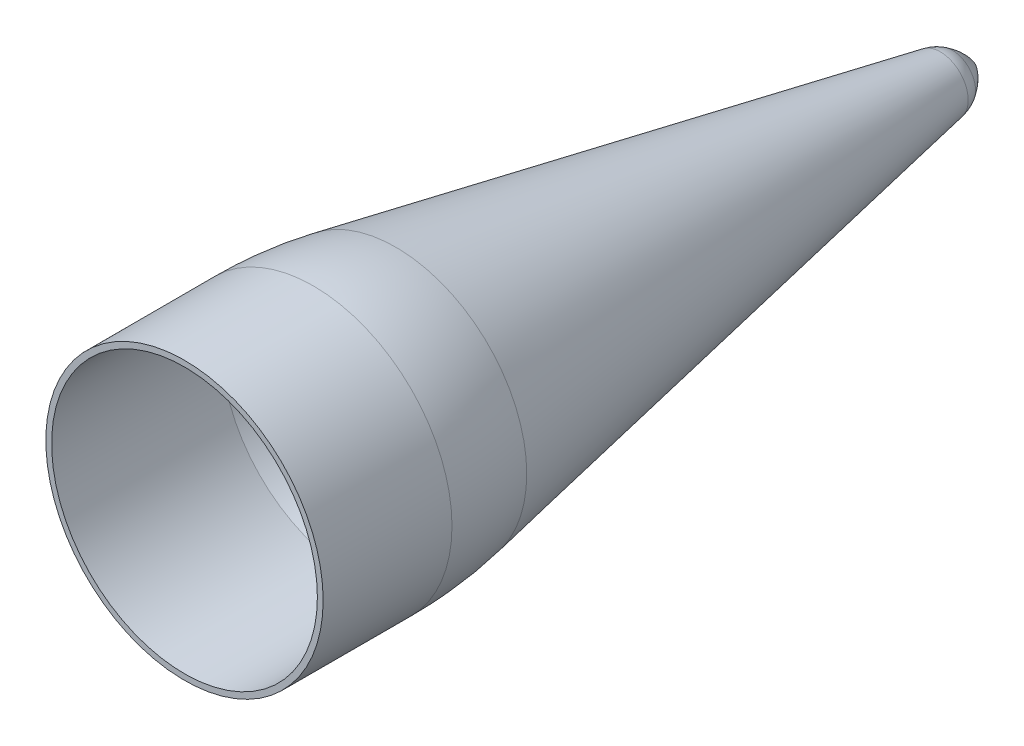
ISO-10303-21;
HEADER;
FILE_DESCRIPTION(('STEP AP214'),'2;1');
FILE_NAME('part.step','',(''),(''),'','','');
FILE_SCHEMA(('AUTOMOTIVE_DESIGN { 1 0 10303 214 1 1 1 1 }'));
ENDSEC;
DATA;
#1=APPLICATION_CONTEXT('core data for automotive mechanical design processes');
#2=APPLICATION_PROTOCOL_DEFINITION('international standard','automotive_design',2000,#1);
#3=PRODUCT_CONTEXT('',#1,'mechanical');
#4=PRODUCT('Part','Part','',(#3));
#5=PRODUCT_RELATED_PRODUCT_CATEGORY('part','',(#4));
#6=PRODUCT_DEFINITION_FORMATION('','',#4);
#7=PRODUCT_DEFINITION_CONTEXT('part definition',#1,'design');
#8=PRODUCT_DEFINITION('design','',#6,#7);
#9=PRODUCT_DEFINITION_SHAPE('','',#8);
#10=(LENGTH_UNIT() NAMED_UNIT(*) SI_UNIT(.MILLI.,.METRE.));
#11=(NAMED_UNIT(*) PLANE_ANGLE_UNIT() SI_UNIT($,.RADIAN.));
#12=(NAMED_UNIT(*) SI_UNIT($,.STERADIAN.) SOLID_ANGLE_UNIT());
#13=UNCERTAINTY_MEASURE_WITH_UNIT(LENGTH_MEASURE(1.E-05),#10,'distance_accuracy_value','');
#14=(GEOMETRIC_REPRESENTATION_CONTEXT(3) GLOBAL_UNCERTAINTY_ASSIGNED_CONTEXT((#13)) GLOBAL_UNIT_ASSIGNED_CONTEXT((#10,
#11,#12)) REPRESENTATION_CONTEXT('',''));
#15=CARTESIAN_POINT('',(0.,0.,0.));
#16=DIRECTION('',(0.,0.,1.));
#17=DIRECTION('',(1.,0.,0.));
#18=AXIS2_PLACEMENT_3D('',#15,#16,#17);
#19=CARTESIAN_POINT('',(0.,0.,0.));
#20=DIRECTION('',(0.,0.,1.));
#21=DIRECTION('',(1.,0.,0.));
#22=AXIS2_PLACEMENT_3D('',#19,#20,#21);
#23=PLANE('',#22);
#24=CARTESIAN_POINT('',(0.,0.,0.));
#25=DIRECTION('',(0.,0.,1.));
#26=DIRECTION('',(1.,0.,0.));
#27=AXIS2_PLACEMENT_3D('',#24,#25,#26);
#28=CIRCLE('',#27,76.073);
#29=CARTESIAN_POINT('',(76.073,0.,0.));
#30=VERTEX_POINT('',#29);
#31=EDGE_CURVE('E68',#30,#30,#28,.T.);
#32=ORIENTED_EDGE('',*,*,#31,.F.);
#33=EDGE_LOOP('',(#32));
#34=FACE_BOUND('',#33,.T.);
#35=CARTESIAN_POINT('',(0.,0.,0.));
#36=DIRECTION('',(0.,0.,1.));
#37=DIRECTION('',(1.,0.,0.));
#38=AXIS2_PLACEMENT_3D('',#35,#36,#37);
#39=CIRCLE('',#38,79.375);
#40=CARTESIAN_POINT('',(79.375,0.,0.));
#41=VERTEX_POINT('',#40);
#42=EDGE_CURVE('E73',#41,#41,#39,.T.);
#43=ORIENTED_EDGE('',*,*,#42,.T.);
#44=EDGE_LOOP('',(#43));
#45=FACE_BOUND('',#44,.T.);
#46=ADVANCED_FACE('F41',(#34,#45),#23,.T.);
#47=CARTESIAN_POINT('',(0.,0.,-20.6182153063899));
#48=DIRECTION('',(0.,0.,1.));
#49=DIRECTION('',(1.,0.,0.));
#50=AXIS2_PLACEMENT_3D('',#47,#48,#49);
#51=CYLINDRICAL_SURFACE('',#50,79.375);
#52=CARTESIAN_POINT('',(0.,0.,-73.747414039917));
#53=DIRECTION('',(0.,0.,-1.));
#54=DIRECTION('',(-1.,0.,0.));
#55=AXIS2_PLACEMENT_3D('',#52,#53,#54);
#56=CIRCLE('',#55,79.375);
#57=CARTESIAN_POINT('',(-79.375,0.,-73.747414039917));
#58=VERTEX_POINT('',#57);
#59=EDGE_CURVE('E76',#58,#58,#56,.F.);
#60=ORIENTED_EDGE('',*,*,#59,.T.);
#61=EDGE_LOOP('',(#60));
#62=FACE_BOUND('',#61,.T.);
#63=ORIENTED_EDGE('',*,*,#42,.F.);
#64=EDGE_LOOP('',(#63));
#65=FACE_BOUND('',#64,.T.);
#66=ADVANCED_FACE('F96',(#62,#65),#51,.T.);
#67=CARTESIAN_POINT('',(0.,0.,-97.5664527808306));
#68=DIRECTION('',(0.,0.,1.));
#69=DIRECTION('',(1.,0.,0.));
#70=AXIS2_PLACEMENT_3D('',#67,#68,#69);
#71=CONICAL_SURFACE('',#70,79.375,0.187004599771542);
#72=CARTESIAN_POINT('',(0.,0.,-432.640757610066));
#73=DIRECTION('',(0.,0.,-1.));
#74=DIRECTION('',(-1.,0.,0.));
#75=AXIS2_PLACEMENT_3D('',#72,#73,#74);
#76=CIRCLE('',#75,15.9737727412674);
#77=CARTESIAN_POINT('',(15.9737727412674,0.,-432.640757610066));
#78=VERTEX_POINT('',#77);
#79=EDGE_CURVE('E49',#78,#78,#76,.F.);
#80=CARTESIAN_POINT('',(0.,0.,-120.97021936672));
#81=DIRECTION('',(0.,0.,-1.));
#82=DIRECTION('',(-1.,0.,0.));
#83=AXIS2_PLACEMENT_3D('',#80,#81,#82);
#84=CIRCLE('',#83,74.9466463404184);
#85=CARTESIAN_POINT('',(74.9466463404184,0.,-120.97021936672));
#86=VERTEX_POINT('',#85);
#87=EDGE_CURVE('E79',#86,#86,#84,.T.);
#88=CARTESIAN_POINT('',(15.9737727412674,0.,-432.640757610066));
#89=CARTESIAN_POINT('',(16.5880735079252,0.,-429.394189503365));
#90=CARTESIAN_POINT('',(17.202374274583,0.,-426.147621396663));
#91=CARTESIAN_POINT('',(18.4309758078987,0.,-419.65448518326));
#92=CARTESIAN_POINT('',(19.0452765745565,0.,-416.407917076559));
#93=CARTESIAN_POINT('',(20.2738781078721,0.,-409.914780863156));
#94=CARTESIAN_POINT('',(20.88817887453,0.,-406.668212756454));
#95=CARTESIAN_POINT('',(22.1167804078456,0.,-400.175076543051));
#96=CARTESIAN_POINT('',(22.7310811745034,0.,-396.92850843635));
#97=CARTESIAN_POINT('',(23.9596827078191,0.,-390.435372222947));
#98=CARTESIAN_POINT('',(24.5739834744769,0.,-387.188804116245));
#99=CARTESIAN_POINT('',(25.8025850077925,0.,-380.695667902842));
#100=CARTESIAN_POINT('',(26.4168857744504,0.,-377.449099796141));
#101=CARTESIAN_POINT('',(27.645487307766,0.,-370.955963582737));
#102=CARTESIAN_POINT('',(28.2597880744238,0.,-367.709395476036));
#103=CARTESIAN_POINT('',(29.4883896077395,0.,-361.216259262633));
#104=CARTESIAN_POINT('',(30.1026903743973,0.,-357.969691155931));
#105=CARTESIAN_POINT('',(31.3312919077129,0.,-351.476554942528));
#106=CARTESIAN_POINT('',(31.9455926743708,0.,-348.229986835827));
#107=CARTESIAN_POINT('',(33.1741942076864,0.,-341.736850622424));
#108=CARTESIAN_POINT('',(33.7884949743442,0.,-338.490282515722));
#109=CARTESIAN_POINT('',(35.0170965076599,0.,-331.997146302319));
#110=CARTESIAN_POINT('',(35.6313972743177,0.,-328.750578195618));
#111=CARTESIAN_POINT('',(36.8599988076334,0.,-322.257441982215));
#112=CARTESIAN_POINT('',(37.4742995742912,0.,-319.010873875513));
#113=CARTESIAN_POINT('',(38.7029011076068,0.,-312.51773766211));
#114=CARTESIAN_POINT('',(39.3172018742646,0.,-309.271169555409));
#115=CARTESIAN_POINT('',(40.5458034075803,0.,-302.778033342005));
#116=CARTESIAN_POINT('',(41.1601041742381,0.,-299.531465235304));
#117=CARTESIAN_POINT('',(42.3887057075538,0.,-293.038329021901));
#118=CARTESIAN_POINT('',(43.0030064742116,0.,-289.791760915199));
#119=CARTESIAN_POINT('',(44.2316080075272,0.,-283.298624701796));
#120=CARTESIAN_POINT('',(44.845908774185,0.,-280.052056595095));
#121=CARTESIAN_POINT('',(46.0745103075007,0.,-273.558920381692));
#122=CARTESIAN_POINT('',(46.6888110741585,0.,-270.31235227499));
#123=CARTESIAN_POINT('',(47.9174126074742,0.,-263.819216061587));
#124=CARTESIAN_POINT('',(48.531713374132,0.,-260.572647954886));
#125=CARTESIAN_POINT('',(49.7603149074476,0.,-254.079511741483));
#126=CARTESIAN_POINT('',(50.3746156741054,0.,-250.832943634781));
#127=CARTESIAN_POINT('',(51.6032172074211,0.,-244.339807421378));
#128=CARTESIAN_POINT('',(52.2175179740789,0.,-241.093239314677));
#129=CARTESIAN_POINT('',(53.4461195073946,0.,-234.600103101274));
#130=CARTESIAN_POINT('',(54.0604202740524,0.,-231.353534994572));
#131=CARTESIAN_POINT('',(55.289021807368,0.,-224.860398781169));
#132=CARTESIAN_POINT('',(55.9033225740259,0.,-221.613830674467));
#133=CARTESIAN_POINT('',(57.1319241073415,0.,-215.120694461064));
#134=CARTESIAN_POINT('',(57.7462248739993,0.,-211.874126354363));
#135=CARTESIAN_POINT('',(58.974826407315,0.,-205.38099014096));
#136=CARTESIAN_POINT('',(59.5891271739728,0.,-202.134422034258));
#137=CARTESIAN_POINT('',(60.8177287072884,0.,-195.641285820855));
#138=CARTESIAN_POINT('',(61.4320294739463,0.,-192.394717714154));
#139=CARTESIAN_POINT('',(62.6606310072619,0.,-185.901581500751));
#140=CARTESIAN_POINT('',(63.2749317739197,0.,-182.655013394049));
#141=CARTESIAN_POINT('',(64.5035333072354,0.,-176.161877180646));
#142=CARTESIAN_POINT('',(65.1178340738932,0.,-172.915309073945));
#143=CARTESIAN_POINT('',(66.3464356072088,0.,-166.422172860542));
#144=CARTESIAN_POINT('',(66.9607363738667,0.,-163.17560475384));
#145=CARTESIAN_POINT('',(68.1893379071823,0.,-156.682468540437));
#146=CARTESIAN_POINT('',(68.8036386738401,0.,-153.435900433735));
#147=CARTESIAN_POINT('',(70.0322402071558,0.,-146.942764220332));
#148=CARTESIAN_POINT('',(70.6465409738136,0.,-143.696196113631));
#149=CARTESIAN_POINT('',(71.8751425071292,0.,-137.203059900228));
#150=CARTESIAN_POINT('',(72.4894432737871,0.,-133.956491793526));
#151=CARTESIAN_POINT('',(73.7180448071027,0.,-127.463355580123));
#152=CARTESIAN_POINT('',(74.3323455737605,0.,-124.216787473422));
#153=CARTESIAN_POINT('',(74.9466463404184,0.,-120.97021936672));
#154=B_SPLINE_CURVE_WITH_KNOTS('',3,(#88,#89,#90,#91,#92,#93,#94,#95,#96,#97,#98,#99,#100,#101,
#102,#103,#104,#105,#106,#107,#108,#109,#110,#111,#112,#113,#114,#115,#116,#117,#118,#119,#120,
#121,#122,#123,#124,#125,#126,#127,#128,#129,#130,#131,#132,#133,#134,#135,#136,#137,#138,#139,
#140,#141,#142,#143,#144,#145,#146,#147,#148,#149,#150,#151,#152,#153),.UNSPECIFIED.,.F.,.F.,(4,
2,2,2,2,2,2,2,2,2,2,2,2,2,2,2,2,2,2,2,2,2,2,2,2,2,2,2,2,2,2,2,4),(0.,9.91252385269816,
19.8250477053964,29.7375715580946,39.6500954107929,49.562619263491,59.4751431161893,
69.3876669688875,79.3001908215857,89.2127146742839,99.1252385269822,109.03776237968,
118.950286232379,128.862810085077,138.775333937775,148.687857790473,158.600381643171,
168.51290549587,178.425429348568,188.337953201266,198.250477053964,208.163000906663,
218.075524759361,227.988048612059,237.900572464757,247.813096317455,257.725620170154,
267.638144022852,277.55066787555,287.463191728248,297.375715580946,307.288239433645,
317.200763286343),.UNSPECIFIED.);
#155=EDGE_CURVE('BSEAM84',#78,#86,#154,.T.);
#156=ORIENTED_EDGE('',*,*,#79,.T.);
#157=ORIENTED_EDGE('',*,*,#87,.T.);
#158=ORIENTED_EDGE('',*,*,#155,.T.);
#159=ORIENTED_EDGE('',*,*,#155,.F.);
#160=EDGE_LOOP('',(#156,#158,#157,#159));
#161=FACE_BOUND('',#160,.T.);
#162=ADVANCED_FACE('F84',(#161),#71,.T.);
#163=CARTESIAN_POINT('',(-18.2732845576005,0.,-420.052630227537));
#164=DIRECTION('',(0.,-1.,0.));
#165=DIRECTION('',(1.,0.,0.));
#166=AXIS2_PLACEMENT_3D('',#163,#164,#165);
#167=CIRCLE('',#166,37.1002770786884);
#168=TRIMMED_CURVE('',#167,(PARAMETER_VALUE(-1.05579306901435)),
(PARAMETER_VALUE(1.05579306901435)),.T.,.PARAMETER.);
#169=CARTESIAN_POINT('',(0.,0.,-420.052630227537));
#170=DIRECTION('',(0.,0.,1.));
#171=AXIS1_PLACEMENT('',#169,#170);
#172=SURFACE_OF_REVOLUTION('',#168,#171);
#173=CARTESIAN_POINT('',(0.,0.,-439.531729368528));
#174=DIRECTION('',(0.,0.,1.));
#175=DIRECTION('',(1.,0.,0.));
#176=AXIS2_PLACEMENT_3D('',#173,#174,#175);
#177=CIRCLE('',#176,13.3019471275496);
#178=CARTESIAN_POINT('',(13.3019471275496,0.,-439.531729368528));
#179=VERTEX_POINT('',#178);
#180=EDGE_CURVE('E11',#179,#179,#177,.F.);
#181=ORIENTED_EDGE('',*,*,#180,.T.);
#182=EDGE_LOOP('',(#181));
#183=FACE_BOUND('',#182,.T.);
#184=CARTESIAN_POINT('',(0.,0.,-452.340671834182));
#185=VERTEX_POINT('',#184);
#186=VERTEX_LOOP('',#185);
#187=FACE_BOUND('',#186,.T.);
#188=ADVANCED_FACE('F110',(#183,#187),#172,.T.);
#189=CARTESIAN_POINT('',(0.,0.,-20.6182153063899));
#190=DIRECTION('',(0.,0.,1.));
#191=DIRECTION('',(1.,0.,0.));
#192=AXIS2_PLACEMENT_3D('',#189,#190,#191);
#193=CYLINDRICAL_SURFACE('',#192,76.073);
#194=CARTESIAN_POINT('',(0.,0.,-97.2568052771987));
#195=DIRECTION('',(0.,0.,1.));
#196=DIRECTION('',(1.,0.,0.));
#197=AXIS2_PLACEMENT_3D('',#194,#195,#196);
#198=CIRCLE('',#197,76.073);
#199=CARTESIAN_POINT('',(76.073,0.,-97.2568052771987));
#200=VERTEX_POINT('',#199);
#201=EDGE_CURVE('E65',#200,#200,#198,.T.);
#202=ORIENTED_EDGE('',*,*,#201,.F.);
#203=EDGE_LOOP('',(#202));
#204=FACE_BOUND('',#203,.T.);
#205=ORIENTED_EDGE('',*,*,#31,.T.);
#206=EDGE_LOOP('',(#205));
#207=FACE_BOUND('',#206,.T.);
#208=ADVANCED_FACE('F111',(#204,#207),#193,.F.);
#209=CARTESIAN_POINT('',(0.,0.,-96.9525563115821));
#210=DIRECTION('',(0.,0.,1.));
#211=DIRECTION('',(1.,0.,0.));
#212=AXIS2_PLACEMENT_3D('',#209,#210,#211);
#213=CONICAL_SURFACE('',#212,76.1305685975746,0.187004599771542);
#214=CARTESIAN_POINT('',(0.,0.,-434.570694123745));
#215=DIRECTION('',(0.,0.,1.));
#216=DIRECTION('',(1.,0.,0.));
#217=AXIS2_PLACEMENT_3D('',#214,#215,#216);
#218=CIRCLE('',#217,12.2480088978449);
#219=CARTESIAN_POINT('',(12.2480088978449,0.,-434.570694123745));
#220=VERTEX_POINT('',#219);
#221=EDGE_CURVE('E63',#220,#220,#218,.T.);
#222=CARTESIAN_POINT('',(12.2480088978449,0.,-434.570694123745));
#223=CARTESIAN_POINT('',(12.912852555159,0.,-431.057007781594));
#224=CARTESIAN_POINT('',(13.5776962124731,0.,-427.543321439442));
#225=CARTESIAN_POINT('',(14.9073835271014,0.,-420.515948755139));
#226=CARTESIAN_POINT('',(15.5722271844155,0.,-417.002262412988));
#227=CARTESIAN_POINT('',(16.9019144990437,0.,-409.974889728685));
#228=CARTESIAN_POINT('',(17.5667581563578,0.,-406.461203386533));
#229=CARTESIAN_POINT('',(18.8964454709861,0.,-399.43383070223));
#230=CARTESIAN_POINT('',(19.5612891283002,0.,-395.920144360079));
#231=CARTESIAN_POINT('',(20.8909764429284,0.,-388.892771675776));
#232=CARTESIAN_POINT('',(21.5558201002425,0.,-385.379085333624));
#233=CARTESIAN_POINT('',(22.8855074148708,0.,-378.351712649321));
#234=CARTESIAN_POINT('',(23.5503510721849,0.,-374.838026307169));
#235=CARTESIAN_POINT('',(24.8800383868131,0.,-367.810653622866));
#236=CARTESIAN_POINT('',(25.5448820441272,0.,-364.296967280715));
#237=CARTESIAN_POINT('',(26.8745693587554,0.,-357.269594596412));
#238=CARTESIAN_POINT('',(27.5394130160696,0.,-353.75590825426));
#239=CARTESIAN_POINT('',(28.8691003306978,0.,-346.728535569957));
#240=CARTESIAN_POINT('',(29.5339439880119,0.,-343.214849227806));
#241=CARTESIAN_POINT('',(30.8636313026401,0.,-336.187476543503));
#242=CARTESIAN_POINT('',(31.5284749599543,0.,-332.673790201351));
#243=CARTESIAN_POINT('',(32.8581622745825,0.,-325.646417517048));
#244=CARTESIAN_POINT('',(33.5230059318966,0.,-322.132731174897));
#245=CARTESIAN_POINT('',(34.8526932465248,0.,-315.105358490593));
#246=CARTESIAN_POINT('',(35.5175369038389,0.,-311.591672148442));
#247=CARTESIAN_POINT('',(36.8472242184672,0.,-304.564299464139));
#248=CARTESIAN_POINT('',(37.5120678757813,0.,-301.050613121987));
#249=CARTESIAN_POINT('',(38.8417551904095,0.,-294.023240437684));
#250=CARTESIAN_POINT('',(39.5065988477236,0.,-290.509554095533));
#251=CARTESIAN_POINT('',(40.8362861623519,0.,-283.48218141123));
#252=CARTESIAN_POINT('',(41.501129819666,0.,-279.968495069078));
#253=CARTESIAN_POINT('',(42.8308171342942,0.,-272.941122384775));
#254=CARTESIAN_POINT('',(43.4956607916083,0.,-269.427436042624));
#255=CARTESIAN_POINT('',(44.8253481062366,0.,-262.400063358321));
#256=CARTESIAN_POINT('',(45.4901917635507,0.,-258.886377016169));
#257=CARTESIAN_POINT('',(46.8198790781789,0.,-251.859004331866));
#258=CARTESIAN_POINT('',(47.484722735493,0.,-248.345317989714));
#259=CARTESIAN_POINT('',(48.8144100501213,0.,-241.317945305411));
#260=CARTESIAN_POINT('',(49.4792537074354,0.,-237.80425896326));
#261=CARTESIAN_POINT('',(50.8089410220636,0.,-230.776886278957));
#262=CARTESIAN_POINT('',(51.4737846793777,0.,-227.263199936805));
#263=CARTESIAN_POINT('',(52.803471994006,0.,-220.235827252502));
#264=CARTESIAN_POINT('',(53.4683156513201,0.,-216.722140910351));
#265=CARTESIAN_POINT('',(54.7980029659483,0.,-209.694768226048));
#266=CARTESIAN_POINT('',(55.4628466232624,0.,-206.181081883896));
#267=CARTESIAN_POINT('',(56.7925339378906,0.,-199.153709199593));
#268=CARTESIAN_POINT('',(57.4573775952048,0.,-195.640022857441));
#269=CARTESIAN_POINT('',(58.787064909833,0.,-188.612650173138));
#270=CARTESIAN_POINT('',(59.4519085671471,0.,-185.098963830987));
#271=CARTESIAN_POINT('',(60.7815958817753,0.,-178.071591146684));
#272=CARTESIAN_POINT('',(61.4464395390895,0.,-174.557904804532));
#273=CARTESIAN_POINT('',(62.7761268537177,0.,-167.530532120229));
#274=CARTESIAN_POINT('',(63.4409705110318,0.,-164.016845778078));
#275=CARTESIAN_POINT('',(64.77065782566,0.,-156.989473093775));
#276=CARTESIAN_POINT('',(65.4355014829742,0.,-153.475786751623));
#277=CARTESIAN_POINT('',(66.7651887976024,0.,-146.44841406732));
#278=CARTESIAN_POINT('',(67.4300324549165,0.,-142.934727725169));
#279=CARTESIAN_POINT('',(68.7597197695447,0.,-135.907355040866));
#280=CARTESIAN_POINT('',(69.4245634268589,0.,-132.393668698714));
#281=CARTESIAN_POINT('',(70.7542507414871,0.,-125.366296014411));
#282=CARTESIAN_POINT('',(71.4190943988012,0.,-121.852609672259));
#283=CARTESIAN_POINT('',(72.7487817134294,0.,-114.825236987956));
#284=CARTESIAN_POINT('',(73.4136253707435,0.,-111.311550645805));
#285=CARTESIAN_POINT('',(74.7433126853718,0.,-104.284177961502));
#286=CARTESIAN_POINT('',(75.4081563426859,0.,-100.77049161935));
#287=CARTESIAN_POINT('',(76.073,0.,-97.2568052771987));
#288=B_SPLINE_CURVE_WITH_KNOTS('',3,(#222,#223,#224,#225,#226,#227,#228,#229,#230,#231,#232,
#233,#234,#235,#236,#237,#238,#239,#240,#241,#242,#243,#244,#245,#246,#247,#248,#249,#250,#251,
#252,#253,#254,#255,#256,#257,#258,#259,#260,#261,#262,#263,#264,#265,#266,#267,#268,#269,#270,
#271,#272,#273,#274,#275,#276,#277,#278,#279,#280,#281,#282,#283,#284,#285,#286,#287),
.UNSPECIFIED.,.F.,.F.,(4,2,2,2,2,2,2,2,2,2,2,2,2,2,2,2,2,2,2,2,2,2,2,2,2,2,2,2,2,2,2,2,4),(0.,
10.7280976504335,21.456195300867,32.1842929513005,42.912390601734,53.6404882521676,
64.368585902601,75.0966835530346,85.8247812034681,96.5528788539016,107.280976504335,
118.009074154769,128.737171805202,139.465269455636,150.193367106069,160.921464756503,
171.649562406936,182.37766005737,193.105757707803,203.833855358237,214.56195300867,
225.290050659104,236.018148309537,246.746245959971,257.474343610404,268.202441260838,
278.930538911271,289.658636561705,300.386734212138,311.114831862572,321.842929513005,
332.571027163439,343.299124813872),.UNSPECIFIED.);
#289=EDGE_CURVE('BSEAM59',#220,#200,#288,.T.);
#290=ORIENTED_EDGE('',*,*,#221,.F.);
#291=ORIENTED_EDGE('',*,*,#201,.T.);
#292=ORIENTED_EDGE('',*,*,#289,.T.);
#293=ORIENTED_EDGE('',*,*,#289,.F.);
#294=EDGE_LOOP('',(#290,#292,#291,#293));
#295=FACE_BOUND('',#294,.T.);
#296=ADVANCED_FACE('F59',(#295),#213,.F.);
#297=CARTESIAN_POINT('',(-18.2732845576005,0.,-420.052630227537));
#298=DIRECTION('',(0.,-1.,0.));
#299=DIRECTION('',(1.,0.,0.));
#300=AXIS2_PLACEMENT_3D('',#297,#298,#299);
#301=CIRCLE('',#300,33.7982770786884);
#302=TRIMMED_CURVE('',#301,(PARAMETER_VALUE(-0.999578093193702)),
(PARAMETER_VALUE(0.999578093193702)),.T.,.PARAMETER.);
#303=CARTESIAN_POINT('',(0.,0.,-420.052630227537));
#304=DIRECTION('',(0.,0.,1.));
#305=AXIS1_PLACEMENT('',#303,#304);
#306=SURFACE_OF_REVOLUTION('',#302,#305);
#307=CARTESIAN_POINT('',(0.,0.,-448.485192633426));
#308=VERTEX_POINT('',#307);
#309=VERTEX_LOOP('',#308);
#310=FACE_BOUND('',#309,.T.);
#311=ORIENTED_EDGE('',*,*,#221,.T.);
#312=EDGE_LOOP('',(#311));
#313=FACE_BOUND('',#312,.T.);
#314=ADVANCED_FACE('F55',(#310,#313),#306,.F.);
#315=CARTESIAN_POINT('',(0.,0.,-73.747414039917));
#316=DIRECTION('',(0.,0.,-1.));
#317=DIRECTION('',(-1.,0.,0.));
#318=AXIS2_PLACEMENT_3D('',#315,#316,#317);
#319=DEGENERATE_TOROIDAL_SURFACE('',#318,174.625,254.,.F.);
#320=ORIENTED_EDGE('',*,*,#87,.F.);
#321=EDGE_LOOP('',(#320));
#322=FACE_BOUND('',#321,.T.);
#323=ORIENTED_EDGE('',*,*,#59,.F.);
#324=EDGE_LOOP('',(#323));
#325=FACE_BOUND('',#324,.T.);
#326=ADVANCED_FACE('F58',(#322,#325),#319,.F.);
#327=CARTESIAN_POINT('',(0.,0.,-428.862933183922));
#328=DIRECTION('',(0.,0.,-1.));
#329=DIRECTION('',(-1.,0.,0.));
#330=AXIS2_PLACEMENT_3D('',#327,#328,#329);
#331=DEGENERATE_TOROIDAL_SURFACE('',#330,3.99195896596609,20.32,.F.);
#332=ORIENTED_EDGE('',*,*,#180,.F.);
#333=EDGE_LOOP('',(#332));
#334=FACE_BOUND('',#333,.T.);
#335=ORIENTED_EDGE('',*,*,#79,.F.);
#336=EDGE_LOOP('',(#335));
#337=FACE_BOUND('',#336,.T.);
#338=ADVANCED_FACE('F43',(#334,#337),#331,.F.);
#339=CLOSED_SHELL('',(#46,#66,#162,#188,#208,#296,#314,#326,#338));
#340=MANIFOLD_SOLID_BREP('B2',#339);
#341=ADVANCED_BREP_SHAPE_REPRESENTATION('',(#18,#340),#14);
#342=SHAPE_DEFINITION_REPRESENTATION(#9,#341);
ENDSEC;
END-ISO-10303-21;
